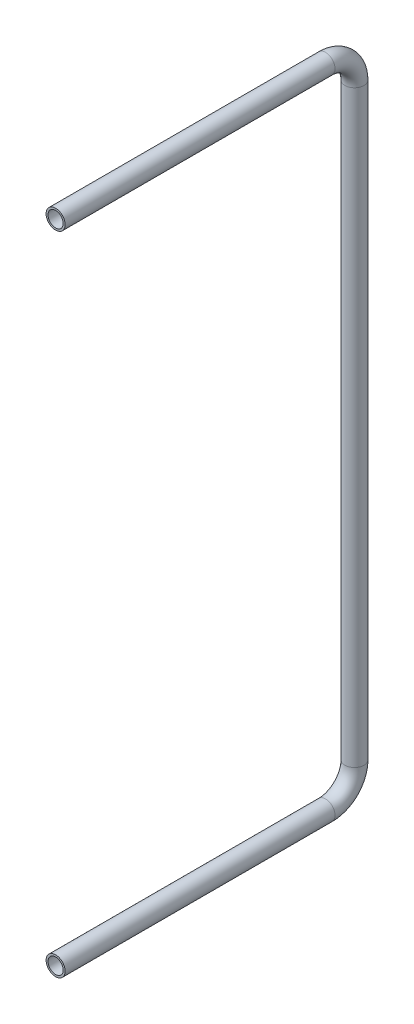
ISO-10303-21;
HEADER;
FILE_DESCRIPTION(('STEP AP214'),'2;1');
FILE_NAME('part.step','',(''),(''),'','','');
FILE_SCHEMA(('AUTOMOTIVE_DESIGN { 1 0 10303 214 1 1 1 1 }'));
ENDSEC;
DATA;
#1=APPLICATION_CONTEXT('core data for automotive mechanical design processes');
#2=APPLICATION_PROTOCOL_DEFINITION('international standard','automotive_design',2000,#1);
#3=PRODUCT_CONTEXT('',#1,'mechanical');
#4=PRODUCT('Part','Part','',(#3));
#5=PRODUCT_RELATED_PRODUCT_CATEGORY('part','',(#4));
#6=PRODUCT_DEFINITION_FORMATION('','',#4);
#7=PRODUCT_DEFINITION_CONTEXT('part definition',#1,'design');
#8=PRODUCT_DEFINITION('design','',#6,#7);
#9=PRODUCT_DEFINITION_SHAPE('','',#8);
#10=(LENGTH_UNIT() NAMED_UNIT(*) SI_UNIT(.MILLI.,.METRE.));
#11=(NAMED_UNIT(*) PLANE_ANGLE_UNIT() SI_UNIT($,.RADIAN.));
#12=(NAMED_UNIT(*) SI_UNIT($,.STERADIAN.) SOLID_ANGLE_UNIT());
#13=UNCERTAINTY_MEASURE_WITH_UNIT(LENGTH_MEASURE(1.E-05),#10,'distance_accuracy_value','');
#14=(GEOMETRIC_REPRESENTATION_CONTEXT(3) GLOBAL_UNCERTAINTY_ASSIGNED_CONTEXT((#13)) GLOBAL_UNIT_ASSIGNED_CONTEXT((#10,
#11,#12)) REPRESENTATION_CONTEXT('',''));
#15=CARTESIAN_POINT('',(0.,0.,0.));
#16=DIRECTION('',(0.,0.,1.));
#17=DIRECTION('',(1.,0.,0.));
#18=AXIS2_PLACEMENT_3D('',#15,#16,#17);
#19=CARTESIAN_POINT('',(0.,-1084.2625,-524.7005));
#20=DIRECTION('',(0.,1.,0.));
#21=DIRECTION('',(0.,0.,1.));
#22=AXIS2_PLACEMENT_3D('',#19,#20,#21);
#23=CYLINDRICAL_SURFACE('',#22,13.3223);
#24=CARTESIAN_POINT('',(0.,-50.8,-524.7005));
#25=DIRECTION('',(0.,1.,0.));
#26=DIRECTION('',(0.,0.,-1.));
#27=AXIS2_PLACEMENT_3D('',#24,#25,#26);
#28=CIRCLE('',#27,13.3223);
#29=CARTESIAN_POINT('',(0.,-50.8,-538.0228));
#30=VERTEX_POINT('',#29);
#31=EDGE_CURVE('E86',#30,#30,#28,.T.);
#32=ORIENTED_EDGE('',*,*,#31,.T.);
#33=EDGE_LOOP('',(#32));
#34=FACE_BOUND('',#33,.T.);
#35=CARTESIAN_POINT('',(0.,-1084.2625,-524.7005));
#36=DIRECTION('',(0.,1.,0.));
#37=DIRECTION('',(0.,0.,-1.));
#38=AXIS2_PLACEMENT_3D('',#35,#36,#37);
#39=CIRCLE('',#38,13.3223);
#40=CARTESIAN_POINT('',(0.,-1084.2625,-538.0228));
#41=VERTEX_POINT('',#40);
#42=EDGE_CURVE('E81',#41,#41,#39,.F.);
#43=ORIENTED_EDGE('',*,*,#42,.T.);
#44=EDGE_LOOP('',(#43));
#45=FACE_BOUND('',#44,.T.);
#46=ADVANCED_FACE('F14',(#34,#45),#23,.F.);
#47=CARTESIAN_POINT('',(0.,-50.8,-473.9005));
#48=DIRECTION('',(1.,0.,0.));
#49=DIRECTION('',(0.,0.,1.));
#50=AXIS2_PLACEMENT_3D('',#47,#48,#49);
#51=TOROIDAL_SURFACE('',#50,50.8,13.3223);
#52=CARTESIAN_POINT('',(0.,0.,-473.9005));
#53=DIRECTION('',(0.,0.,1.));
#54=DIRECTION('',(1.,0.,0.));
#55=AXIS2_PLACEMENT_3D('',#52,#53,#54);
#56=CIRCLE('',#55,13.3223);
#57=CARTESIAN_POINT('',(13.3223,0.,-473.9005));
#58=VERTEX_POINT('',#57);
#59=EDGE_CURVE('E79',#58,#58,#56,.T.);
#60=ORIENTED_EDGE('',*,*,#59,.T.);
#61=EDGE_LOOP('',(#60));
#62=FACE_BOUND('',#61,.T.);
#63=ORIENTED_EDGE('',*,*,#31,.F.);
#64=EDGE_LOOP('',(#63));
#65=FACE_BOUND('',#64,.T.);
#66=ADVANCED_FACE('F71',(#62,#65),#51,.F.);
#67=CARTESIAN_POINT('',(0.,-1084.2625,-473.9005));
#68=DIRECTION('',(1.,0.,0.));
#69=DIRECTION('',(0.,1.,0.));
#70=AXIS2_PLACEMENT_3D('',#67,#68,#69);
#71=TOROIDAL_SURFACE('',#70,50.8,13.3223);
#72=ORIENTED_EDGE('',*,*,#42,.F.);
#73=EDGE_LOOP('',(#72));
#74=FACE_BOUND('',#73,.T.);
#75=CARTESIAN_POINT('',(0.,-1135.0625,-473.9005));
#76=DIRECTION('',(0.,0.,-1.));
#77=DIRECTION('',(-1.,0.,0.));
#78=AXIS2_PLACEMENT_3D('',#75,#76,#77);
#79=CIRCLE('',#78,13.3223);
#80=CARTESIAN_POINT('',(-13.3223,-1135.0625,-473.9005));
#81=VERTEX_POINT('',#80);
#82=EDGE_CURVE('E77',#81,#81,#79,.F.);
#83=ORIENTED_EDGE('',*,*,#82,.T.);
#84=EDGE_LOOP('',(#83));
#85=FACE_BOUND('',#84,.T.);
#86=ADVANCED_FACE('F67',(#74,#85),#71,.F.);
#87=CARTESIAN_POINT('',(0.,0.,-473.9005));
#88=DIRECTION('',(0.,0.,1.));
#89=DIRECTION('',(1.,0.,0.));
#90=AXIS2_PLACEMENT_3D('',#87,#88,#89);
#91=CYLINDRICAL_SURFACE('',#90,13.3223);
#92=CARTESIAN_POINT('',(0.,0.,0.));
#93=DIRECTION('',(0.,0.,1.));
#94=DIRECTION('',(1.,0.,0.));
#95=AXIS2_PLACEMENT_3D('',#92,#93,#94);
#96=CIRCLE('',#95,13.3223);
#97=CARTESIAN_POINT('',(13.3223,0.,0.));
#98=VERTEX_POINT('',#97);
#99=EDGE_CURVE('E17',#98,#98,#96,.F.);
#100=ORIENTED_EDGE('',*,*,#99,.F.);
#101=EDGE_LOOP('',(#100));
#102=FACE_BOUND('',#101,.T.);
#103=ORIENTED_EDGE('',*,*,#59,.F.);
#104=EDGE_LOOP('',(#103));
#105=FACE_BOUND('',#104,.T.);
#106=ADVANCED_FACE('F63',(#102,#105),#91,.F.);
#107=CARTESIAN_POINT('',(0.,-1135.0625,0.));
#108=DIRECTION('',(0.,0.,-1.));
#109=DIRECTION('',(-1.,0.,0.));
#110=AXIS2_PLACEMENT_3D('',#107,#108,#109);
#111=CYLINDRICAL_SURFACE('',#110,13.3223);
#112=ORIENTED_EDGE('',*,*,#82,.F.);
#113=EDGE_LOOP('',(#112));
#114=FACE_BOUND('',#113,.T.);
#115=CARTESIAN_POINT('',(0.,-1135.0625,0.));
#116=DIRECTION('',(0.,0.,-1.));
#117=DIRECTION('',(-1.,0.,0.));
#118=AXIS2_PLACEMENT_3D('',#115,#116,#117);
#119=CIRCLE('',#118,13.3223);
#120=CARTESIAN_POINT('',(-13.3223,-1135.0625,0.));
#121=VERTEX_POINT('',#120);
#122=EDGE_CURVE('E95',#121,#121,#119,.F.);
#123=ORIENTED_EDGE('',*,*,#122,.T.);
#124=EDGE_LOOP('',(#123));
#125=FACE_BOUND('',#124,.T.);
#126=ADVANCED_FACE('F59',(#114,#125),#111,.F.);
#127=CARTESIAN_POINT('',(0.,0.,0.));
#128=DIRECTION('',(0.,0.,1.));
#129=DIRECTION('',(1.,0.,0.));
#130=AXIS2_PLACEMENT_3D('',#127,#128,#129);
#131=PLANE('',#130);
#132=ORIENTED_EDGE('',*,*,#99,.T.);
#133=EDGE_LOOP('',(#132));
#134=FACE_BOUND('',#133,.T.);
#135=CARTESIAN_POINT('',(0.,0.,0.));
#136=DIRECTION('',(0.,0.,1.));
#137=DIRECTION('',(1.,0.,0.));
#138=AXIS2_PLACEMENT_3D('',#135,#136,#137);
#139=CIRCLE('',#138,16.7005);
#140=CARTESIAN_POINT('',(16.7005,0.,0.));
#141=VERTEX_POINT('',#140);
#142=EDGE_CURVE('E93',#141,#141,#139,.F.);
#143=ORIENTED_EDGE('',*,*,#142,.F.);
#144=EDGE_LOOP('',(#143));
#145=FACE_BOUND('',#144,.T.);
#146=ADVANCED_FACE('F55',(#134,#145),#131,.T.);
#147=CARTESIAN_POINT('',(0.,-1135.0625,0.));
#148=DIRECTION('',(0.,0.,-1.));
#149=DIRECTION('',(-1.,0.,0.));
#150=AXIS2_PLACEMENT_3D('',#147,#148,#149);
#151=PLANE('',#150);
#152=ORIENTED_EDGE('',*,*,#122,.F.);
#153=EDGE_LOOP('',(#152));
#154=FACE_BOUND('',#153,.T.);
#155=CARTESIAN_POINT('',(0.,-1135.0625,0.));
#156=DIRECTION('',(0.,0.,-1.));
#157=DIRECTION('',(-1.,0.,0.));
#158=AXIS2_PLACEMENT_3D('',#155,#156,#157);
#159=CIRCLE('',#158,16.7005);
#160=CARTESIAN_POINT('',(-16.7005,-1135.0625,0.));
#161=VERTEX_POINT('',#160);
#162=EDGE_CURVE('E89',#161,#161,#159,.T.);
#163=ORIENTED_EDGE('',*,*,#162,.F.);
#164=EDGE_LOOP('',(#163));
#165=FACE_BOUND('',#164,.T.);
#166=ADVANCED_FACE('F51',(#154,#165),#151,.F.);
#167=CARTESIAN_POINT('',(0.,0.,-473.9005));
#168=DIRECTION('',(0.,0.,1.));
#169=DIRECTION('',(1.,0.,0.));
#170=AXIS2_PLACEMENT_3D('',#167,#168,#169);
#171=CYLINDRICAL_SURFACE('',#170,16.7005);
#172=ORIENTED_EDGE('',*,*,#142,.T.);
#173=EDGE_LOOP('',(#172));
#174=FACE_BOUND('',#173,.T.);
#175=CARTESIAN_POINT('',(0.,0.,-473.9005));
#176=DIRECTION('',(0.,0.,1.));
#177=DIRECTION('',(0.,1.,0.));
#178=AXIS2_PLACEMENT_3D('',#175,#176,#177);
#179=CIRCLE('',#178,16.7005);
#180=CARTESIAN_POINT('',(0.,16.7005,-473.9005));
#181=VERTEX_POINT('',#180);
#182=EDGE_CURVE('E92',#181,#181,#179,.F.);
#183=ORIENTED_EDGE('',*,*,#182,.F.);
#184=EDGE_LOOP('',(#183));
#185=FACE_BOUND('',#184,.T.);
#186=ADVANCED_FACE('F47',(#174,#185),#171,.T.);
#187=CARTESIAN_POINT('',(0.,-1135.0625,0.));
#188=DIRECTION('',(0.,0.,-1.));
#189=DIRECTION('',(-1.,0.,0.));
#190=AXIS2_PLACEMENT_3D('',#187,#188,#189);
#191=CYLINDRICAL_SURFACE('',#190,16.7005);
#192=CARTESIAN_POINT('',(0.,-1135.0625,-473.9005));
#193=DIRECTION('',(0.,0.,-1.));
#194=DIRECTION('',(0.,-1.,0.));
#195=AXIS2_PLACEMENT_3D('',#192,#193,#194);
#196=CIRCLE('',#195,16.7005);
#197=CARTESIAN_POINT('',(0.,-1151.763,-473.9005));
#198=VERTEX_POINT('',#197);
#199=EDGE_CURVE('E26',#198,#198,#196,.T.);
#200=ORIENTED_EDGE('',*,*,#199,.F.);
#201=EDGE_LOOP('',(#200));
#202=FACE_BOUND('',#201,.T.);
#203=ORIENTED_EDGE('',*,*,#162,.T.);
#204=EDGE_LOOP('',(#203));
#205=FACE_BOUND('',#204,.T.);
#206=ADVANCED_FACE('F43',(#202,#205),#191,.T.);
#207=CARTESIAN_POINT('',(0.,-50.8,-473.9005));
#208=DIRECTION('',(1.,0.,0.));
#209=DIRECTION('',(0.,0.,1.));
#210=AXIS2_PLACEMENT_3D('',#207,#208,#209);
#211=TOROIDAL_SURFACE('',#210,50.8,16.7005);
#212=ORIENTED_EDGE('',*,*,#182,.T.);
#213=EDGE_LOOP('',(#212));
#214=FACE_BOUND('',#213,.T.);
#215=CARTESIAN_POINT('',(0.,-50.8,-524.7005));
#216=DIRECTION('',(0.,1.,0.));
#217=DIRECTION('',(0.,0.,1.));
#218=AXIS2_PLACEMENT_3D('',#215,#216,#217);
#219=CIRCLE('',#218,16.7005);
#220=CARTESIAN_POINT('',(0.,-50.8,-508.));
#221=VERTEX_POINT('',#220);
#222=EDGE_CURVE('E21',#221,#221,#219,.F.);
#223=ORIENTED_EDGE('',*,*,#222,.F.);
#224=EDGE_LOOP('',(#223));
#225=FACE_BOUND('',#224,.T.);
#226=ADVANCED_FACE('F39',(#214,#225),#211,.T.);
#227=CARTESIAN_POINT('',(0.,-1084.2625,-473.9005));
#228=DIRECTION('',(1.,0.,0.));
#229=DIRECTION('',(0.,1.,0.));
#230=AXIS2_PLACEMENT_3D('',#227,#228,#229);
#231=TOROIDAL_SURFACE('',#230,50.8,16.7005);
#232=CARTESIAN_POINT('',(0.,-1084.2625,-524.7005));
#233=DIRECTION('',(0.,1.,0.));
#234=DIRECTION('',(0.,0.,1.));
#235=AXIS2_PLACEMENT_3D('',#232,#233,#234);
#236=CIRCLE('',#235,16.7005);
#237=CARTESIAN_POINT('',(0.,-1084.2625,-508.));
#238=VERTEX_POINT('',#237);
#239=EDGE_CURVE('E10',#238,#238,#236,.T.);
#240=ORIENTED_EDGE('',*,*,#239,.F.);
#241=EDGE_LOOP('',(#240));
#242=FACE_BOUND('',#241,.T.);
#243=ORIENTED_EDGE('',*,*,#199,.T.);
#244=EDGE_LOOP('',(#243));
#245=FACE_BOUND('',#244,.T.);
#246=ADVANCED_FACE('F34',(#242,#245),#231,.T.);
#247=CARTESIAN_POINT('',(0.,-1084.2625,-524.7005));
#248=DIRECTION('',(0.,1.,0.));
#249=DIRECTION('',(0.,0.,1.));
#250=AXIS2_PLACEMENT_3D('',#247,#248,#249);
#251=CYLINDRICAL_SURFACE('',#250,16.7005);
#252=ORIENTED_EDGE('',*,*,#222,.T.);
#253=EDGE_LOOP('',(#252));
#254=FACE_BOUND('',#253,.T.);
#255=ORIENTED_EDGE('',*,*,#239,.T.);
#256=EDGE_LOOP('',(#255));
#257=FACE_BOUND('',#256,.T.);
#258=ADVANCED_FACE('F38',(#254,#257),#251,.T.);
#259=CLOSED_SHELL('',(#46,#66,#86,#106,#126,#146,#166,#186,#206,#226,#246,#258));
#260=MANIFOLD_SOLID_BREP('B1',#259);
#261=ADVANCED_BREP_SHAPE_REPRESENTATION('',(#18,#260),#14);
#262=SHAPE_DEFINITION_REPRESENTATION(#9,#261);
ENDSEC;
END-ISO-10303-21;
